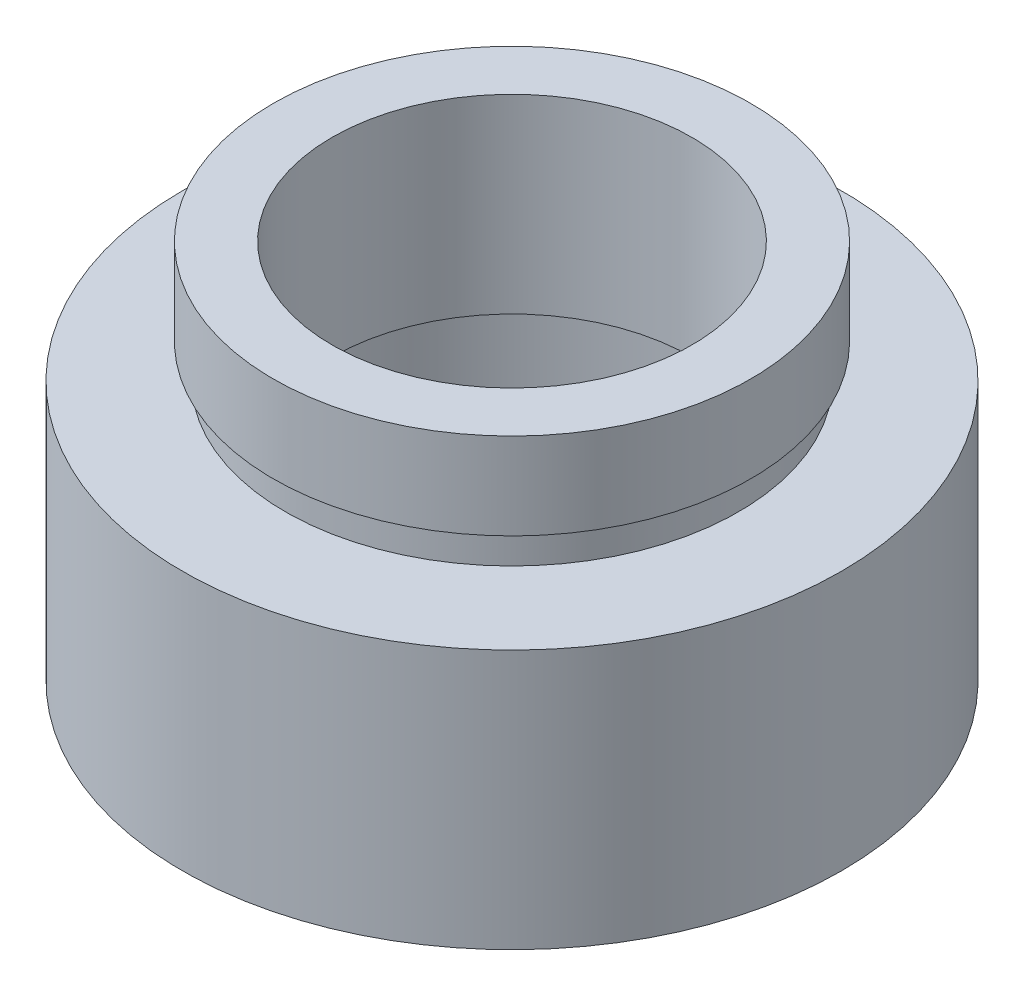
ISO-10303-21;
HEADER;
FILE_DESCRIPTION(('STEP AP214'),'2;1');
FILE_NAME('part.step','',(''),(''),'','','');
FILE_SCHEMA(('AUTOMOTIVE_DESIGN { 1 0 10303 214 1 1 1 1 }'));
ENDSEC;
DATA;
#1=APPLICATION_CONTEXT('core data for automotive mechanical design processes');
#2=APPLICATION_PROTOCOL_DEFINITION('international standard','automotive_design',2000,#1);
#3=PRODUCT_CONTEXT('',#1,'mechanical');
#4=PRODUCT('Part','Part','',(#3));
#5=PRODUCT_RELATED_PRODUCT_CATEGORY('part','',(#4));
#6=PRODUCT_DEFINITION_FORMATION('','',#4);
#7=PRODUCT_DEFINITION_CONTEXT('part definition',#1,'design');
#8=PRODUCT_DEFINITION('design','',#6,#7);
#9=PRODUCT_DEFINITION_SHAPE('','',#8);
#10=(LENGTH_UNIT() NAMED_UNIT(*) SI_UNIT(.MILLI.,.METRE.));
#11=(NAMED_UNIT(*) PLANE_ANGLE_UNIT() SI_UNIT($,.RADIAN.));
#12=(NAMED_UNIT(*) SI_UNIT($,.STERADIAN.) SOLID_ANGLE_UNIT());
#13=UNCERTAINTY_MEASURE_WITH_UNIT(LENGTH_MEASURE(1.E-05),#10,'distance_accuracy_value','');
#14=(GEOMETRIC_REPRESENTATION_CONTEXT(3) GLOBAL_UNCERTAINTY_ASSIGNED_CONTEXT((#13)) GLOBAL_UNIT_ASSIGNED_CONTEXT((#10,
#11,#12)) REPRESENTATION_CONTEXT('',''));
#15=CARTESIAN_POINT('',(0.,0.,0.));
#16=DIRECTION('',(0.,0.,1.));
#17=DIRECTION('',(1.,0.,0.));
#18=AXIS2_PLACEMENT_3D('',#15,#16,#17);
#19=CARTESIAN_POINT('',(9.52500000000001,0.,0.));
#20=DIRECTION('',(0.,1.,0.));
#21=DIRECTION('',(-1.,0.,0.));
#22=AXIS2_PLACEMENT_3D('',#19,#20,#21);
#23=PLANE('',#22);
#24=CARTESIAN_POINT('',(0.,0.,0.));
#25=DIRECTION('',(0.,1.,0.));
#26=DIRECTION('',(-1.,0.,0.));
#27=AXIS2_PLACEMENT_3D('',#24,#25,#26);
#28=CIRCLE('',#27,9.525);
#29=CARTESIAN_POINT('',(-9.525,0.,0.));
#30=VERTEX_POINT('',#29);
#31=EDGE_CURVE('E77',#30,#30,#28,.T.);
#32=ORIENTED_EDGE('',*,*,#31,.F.);
#33=EDGE_LOOP('',(#32));
#34=FACE_BOUND('',#33,.T.);
#35=CARTESIAN_POINT('',(0.,0.,0.));
#36=DIRECTION('',(0.,1.,0.));
#37=DIRECTION('',(-1.,0.,0.));
#38=AXIS2_PLACEMENT_3D('',#35,#36,#37);
#39=CIRCLE('',#38,7.);
#40=CARTESIAN_POINT('',(-7.,0.,0.));
#41=VERTEX_POINT('',#40);
#42=EDGE_CURVE('E10',#41,#41,#39,.T.);
#43=ORIENTED_EDGE('',*,*,#42,.T.);
#44=EDGE_LOOP('',(#43));
#45=FACE_BOUND('',#44,.T.);
#46=ADVANCED_FACE('F37',(#34,#45),#23,.F.);
#47=CARTESIAN_POINT('',(0.,16.8860182370821,0.));
#48=DIRECTION('',(0.,1.,0.));
#49=DIRECTION('',(-1.,0.,0.));
#50=AXIS2_PLACEMENT_3D('',#47,#48,#49);
#51=CYLINDRICAL_SURFACE('',#50,7.);
#52=ORIENTED_EDGE('',*,*,#42,.F.);
#53=EDGE_LOOP('',(#52));
#54=FACE_BOUND('',#53,.T.);
#55=CARTESIAN_POINT('',(0.,4.5,0.));
#56=DIRECTION('',(0.,1.,0.));
#57=DIRECTION('',(-1.,0.,0.));
#58=AXIS2_PLACEMENT_3D('',#55,#56,#57);
#59=CIRCLE('',#58,7.);
#60=CARTESIAN_POINT('',(-7.,4.5,0.));
#61=VERTEX_POINT('',#60);
#62=EDGE_CURVE('E43',#61,#61,#59,.T.);
#63=ORIENTED_EDGE('',*,*,#62,.T.);
#64=EDGE_LOOP('',(#63));
#65=FACE_BOUND('',#64,.T.);
#66=ADVANCED_FACE('F84',(#54,#65),#51,.F.);
#67=CARTESIAN_POINT('',(7.,4.5,0.));
#68=DIRECTION('',(0.,-1.,0.));
#69=DIRECTION('',(1.,0.,0.));
#70=AXIS2_PLACEMENT_3D('',#67,#68,#69);
#71=PLANE('',#70);
#72=ORIENTED_EDGE('',*,*,#62,.F.);
#73=EDGE_LOOP('',(#72));
#74=FACE_BOUND('',#73,.T.);
#75=CARTESIAN_POINT('',(0.,4.5,0.));
#76=DIRECTION('',(0.,1.,0.));
#77=DIRECTION('',(-1.,0.,0.));
#78=AXIS2_PLACEMENT_3D('',#75,#76,#77);
#79=CIRCLE('',#78,7.6);
#80=CARTESIAN_POINT('',(-7.6,4.5,0.));
#81=VERTEX_POINT('',#80);
#82=EDGE_CURVE('E47',#81,#81,#79,.T.);
#83=ORIENTED_EDGE('',*,*,#82,.T.);
#84=EDGE_LOOP('',(#83));
#85=FACE_BOUND('',#84,.T.);
#86=ADVANCED_FACE('F88',(#74,#85),#71,.F.);
#87=CARTESIAN_POINT('',(0.,16.8860182370821,0.));
#88=DIRECTION('',(0.,1.,0.));
#89=DIRECTION('',(-1.,0.,0.));
#90=AXIS2_PLACEMENT_3D('',#87,#88,#89);
#91=CYLINDRICAL_SURFACE('',#90,7.6);
#92=ORIENTED_EDGE('',*,*,#82,.F.);
#93=EDGE_LOOP('',(#92));
#94=FACE_BOUND('',#93,.T.);
#95=CARTESIAN_POINT('',(0.,5.5,0.));
#96=DIRECTION('',(0.,1.,0.));
#97=DIRECTION('',(-1.,0.,0.));
#98=AXIS2_PLACEMENT_3D('',#95,#96,#97);
#99=CIRCLE('',#98,7.6);
#100=CARTESIAN_POINT('',(-7.6,5.5,0.));
#101=VERTEX_POINT('',#100);
#102=EDGE_CURVE('E51',#101,#101,#99,.T.);
#103=ORIENTED_EDGE('',*,*,#102,.T.);
#104=EDGE_LOOP('',(#103));
#105=FACE_BOUND('',#104,.T.);
#106=ADVANCED_FACE('F93',(#94,#105),#91,.F.);
#107=CARTESIAN_POINT('',(5.2,5.5,0.));
#108=DIRECTION('',(0.,1.,0.));
#109=DIRECTION('',(-1.,0.,0.));
#110=AXIS2_PLACEMENT_3D('',#107,#108,#109);
#111=PLANE('',#110);
#112=ORIENTED_EDGE('',*,*,#102,.F.);
#113=EDGE_LOOP('',(#112));
#114=FACE_BOUND('',#113,.T.);
#115=CARTESIAN_POINT('',(0.,5.5,0.));
#116=DIRECTION('',(0.,1.,0.));
#117=DIRECTION('',(-1.,0.,0.));
#118=AXIS2_PLACEMENT_3D('',#115,#116,#117);
#119=CIRCLE('',#118,5.2);
#120=CARTESIAN_POINT('',(-5.2,5.5,0.));
#121=VERTEX_POINT('',#120);
#122=EDGE_CURVE('E56',#121,#121,#119,.T.);
#123=ORIENTED_EDGE('',*,*,#122,.T.);
#124=EDGE_LOOP('',(#123));
#125=FACE_BOUND('',#124,.T.);
#126=ADVANCED_FACE('F99',(#114,#125),#111,.F.);
#127=CARTESIAN_POINT('',(0.,16.8860182370821,0.));
#128=DIRECTION('',(0.,1.,0.));
#129=DIRECTION('',(-1.,0.,0.));
#130=AXIS2_PLACEMENT_3D('',#127,#128,#129);
#131=CYLINDRICAL_SURFACE('',#130,5.2);
#132=ORIENTED_EDGE('',*,*,#122,.F.);
#133=EDGE_LOOP('',(#132));
#134=FACE_BOUND('',#133,.T.);
#135=CARTESIAN_POINT('',(0.,11.,0.));
#136=DIRECTION('',(0.,1.,0.));
#137=DIRECTION('',(-1.,0.,0.));
#138=AXIS2_PLACEMENT_3D('',#135,#136,#137);
#139=CIRCLE('',#138,5.2);
#140=CARTESIAN_POINT('',(-5.2,11.,0.));
#141=VERTEX_POINT('',#140);
#142=EDGE_CURVE('E59',#141,#141,#139,.T.);
#143=ORIENTED_EDGE('',*,*,#142,.T.);
#144=EDGE_LOOP('',(#143));
#145=FACE_BOUND('',#144,.T.);
#146=ADVANCED_FACE('F103',(#134,#145),#131,.F.);
#147=CARTESIAN_POINT('',(5.2,11.,0.));
#148=DIRECTION('',(0.,-1.,0.));
#149=DIRECTION('',(1.,0.,0.));
#150=AXIS2_PLACEMENT_3D('',#147,#148,#149);
#151=PLANE('',#150);
#152=ORIENTED_EDGE('',*,*,#142,.F.);
#153=EDGE_LOOP('',(#152));
#154=FACE_BOUND('',#153,.T.);
#155=CARTESIAN_POINT('',(0.,11.,0.));
#156=DIRECTION('',(0.,1.,0.));
#157=DIRECTION('',(-1.,0.,0.));
#158=AXIS2_PLACEMENT_3D('',#155,#156,#157);
#159=CIRCLE('',#158,6.9);
#160=CARTESIAN_POINT('',(-6.9,11.,0.));
#161=VERTEX_POINT('',#160);
#162=EDGE_CURVE('E62',#161,#161,#159,.T.);
#163=ORIENTED_EDGE('',*,*,#162,.T.);
#164=EDGE_LOOP('',(#163));
#165=FACE_BOUND('',#164,.T.);
#166=ADVANCED_FACE('F107',(#154,#165),#151,.F.);
#167=CARTESIAN_POINT('',(0.,16.8860182370821,0.));
#168=DIRECTION('',(0.,1.,0.));
#169=DIRECTION('',(-1.,0.,0.));
#170=AXIS2_PLACEMENT_3D('',#167,#168,#169);
#171=CYLINDRICAL_SURFACE('',#170,6.9);
#172=ORIENTED_EDGE('',*,*,#162,.F.);
#173=EDGE_LOOP('',(#172));
#174=FACE_BOUND('',#173,.T.);
#175=CARTESIAN_POINT('',(0.,8.5,0.));
#176=DIRECTION('',(0.,1.,0.));
#177=DIRECTION('',(-1.,0.,0.));
#178=AXIS2_PLACEMENT_3D('',#175,#176,#177);
#179=CIRCLE('',#178,6.9);
#180=CARTESIAN_POINT('',(-6.9,8.5,0.));
#181=VERTEX_POINT('',#180);
#182=EDGE_CURVE('E65',#181,#181,#179,.T.);
#183=ORIENTED_EDGE('',*,*,#182,.T.);
#184=EDGE_LOOP('',(#183));
#185=FACE_BOUND('',#184,.T.);
#186=ADVANCED_FACE('F111',(#174,#185),#171,.T.);
#187=CARTESIAN_POINT('',(6.9,8.5,0.));
#188=DIRECTION('',(0.,1.,0.));
#189=DIRECTION('',(-1.,0.,0.));
#190=AXIS2_PLACEMENT_3D('',#187,#188,#189);
#191=PLANE('',#190);
#192=ORIENTED_EDGE('',*,*,#182,.F.);
#193=EDGE_LOOP('',(#192));
#194=FACE_BOUND('',#193,.T.);
#195=CARTESIAN_POINT('',(0.,8.5,0.));
#196=DIRECTION('',(0.,1.,0.));
#197=DIRECTION('',(-1.,0.,0.));
#198=AXIS2_PLACEMENT_3D('',#195,#196,#197);
#199=CIRCLE('',#198,6.55);
#200=CARTESIAN_POINT('',(-6.55,8.5,0.));
#201=VERTEX_POINT('',#200);
#202=EDGE_CURVE('E68',#201,#201,#199,.T.);
#203=ORIENTED_EDGE('',*,*,#202,.T.);
#204=EDGE_LOOP('',(#203));
#205=FACE_BOUND('',#204,.T.);
#206=ADVANCED_FACE('F115',(#194,#205),#191,.F.);
#207=CARTESIAN_POINT('',(0.,16.8860182370821,0.));
#208=DIRECTION('',(0.,1.,0.));
#209=DIRECTION('',(-1.,0.,0.));
#210=AXIS2_PLACEMENT_3D('',#207,#208,#209);
#211=CYLINDRICAL_SURFACE('',#210,6.55);
#212=ORIENTED_EDGE('',*,*,#202,.F.);
#213=EDGE_LOOP('',(#212));
#214=FACE_BOUND('',#213,.T.);
#215=CARTESIAN_POINT('',(0.,7.5,0.));
#216=DIRECTION('',(0.,1.,0.));
#217=DIRECTION('',(-1.,0.,0.));
#218=AXIS2_PLACEMENT_3D('',#215,#216,#217);
#219=CIRCLE('',#218,6.55);
#220=CARTESIAN_POINT('',(-6.55,7.5,0.));
#221=VERTEX_POINT('',#220);
#222=EDGE_CURVE('E71',#221,#221,#219,.T.);
#223=ORIENTED_EDGE('',*,*,#222,.T.);
#224=EDGE_LOOP('',(#223));
#225=FACE_BOUND('',#224,.T.);
#226=ADVANCED_FACE('F119',(#214,#225),#211,.T.);
#227=CARTESIAN_POINT('',(6.55,7.5,0.));
#228=DIRECTION('',(0.,-1.,0.));
#229=DIRECTION('',(1.,0.,0.));
#230=AXIS2_PLACEMENT_3D('',#227,#228,#229);
#231=PLANE('',#230);
#232=ORIENTED_EDGE('',*,*,#222,.F.);
#233=EDGE_LOOP('',(#232));
#234=FACE_BOUND('',#233,.T.);
#235=CARTESIAN_POINT('',(0.,7.5,0.));
#236=DIRECTION('',(0.,1.,0.));
#237=DIRECTION('',(-1.,0.,0.));
#238=AXIS2_PLACEMENT_3D('',#235,#236,#237);
#239=CIRCLE('',#238,9.525);
#240=CARTESIAN_POINT('',(-9.525,7.5,0.));
#241=VERTEX_POINT('',#240);
#242=EDGE_CURVE('E74',#241,#241,#239,.T.);
#243=ORIENTED_EDGE('',*,*,#242,.T.);
#244=EDGE_LOOP('',(#243));
#245=FACE_BOUND('',#244,.T.);
#246=ADVANCED_FACE('F123',(#234,#245),#231,.F.);
#247=CARTESIAN_POINT('',(0.,16.8860182370821,0.));
#248=DIRECTION('',(0.,1.,0.));
#249=DIRECTION('',(-1.,0.,0.));
#250=AXIS2_PLACEMENT_3D('',#247,#248,#249);
#251=CYLINDRICAL_SURFACE('',#250,9.525);
#252=ORIENTED_EDGE('',*,*,#242,.F.);
#253=EDGE_LOOP('',(#252));
#254=FACE_BOUND('',#253,.T.);
#255=ORIENTED_EDGE('',*,*,#31,.T.);
#256=EDGE_LOOP('',(#255));
#257=FACE_BOUND('',#256,.T.);
#258=ADVANCED_FACE('F81',(#254,#257),#251,.T.);
#259=CLOSED_SHELL('',(#46,#66,#86,#106,#126,#146,#166,#186,#206,#226,#246,#258));
#260=MANIFOLD_SOLID_BREP('B2',#259);
#261=ADVANCED_BREP_SHAPE_REPRESENTATION('',(#18,#260),#14);
#262=SHAPE_DEFINITION_REPRESENTATION(#9,#261);
ENDSEC;
END-ISO-10303-21;
